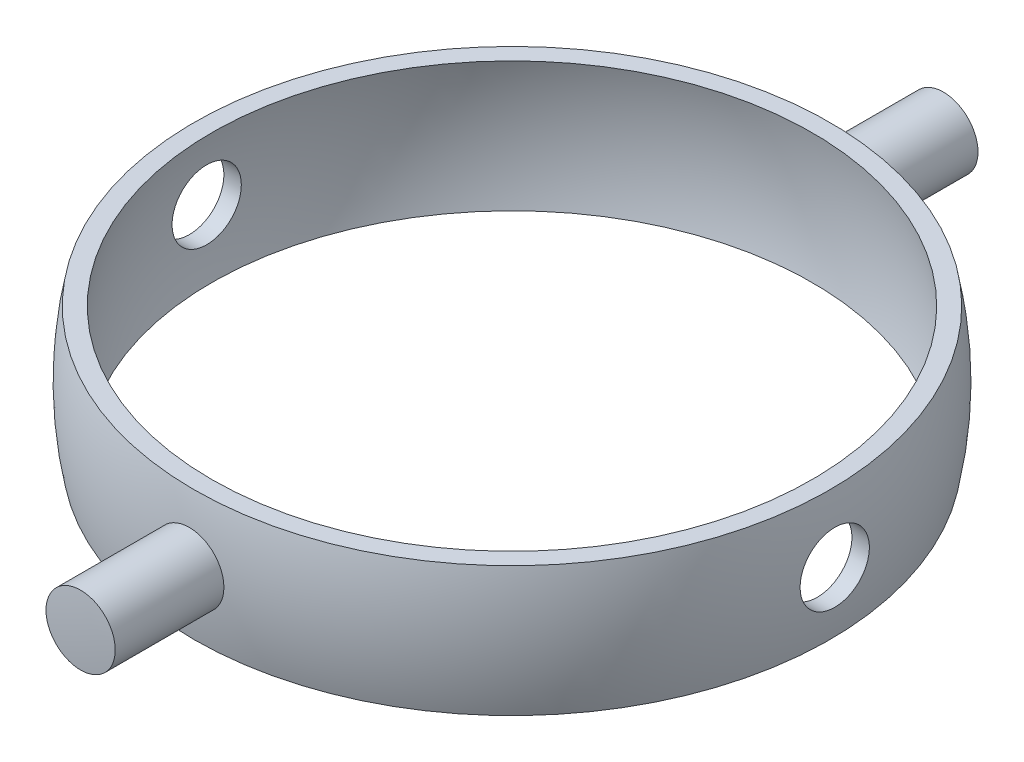
ISO-10303-21;
HEADER;
FILE_DESCRIPTION(('STEP AP214'),'2;1');
FILE_NAME('part.step','',(''),(''),'','','');
FILE_SCHEMA(('AUTOMOTIVE_DESIGN { 1 0 10303 214 1 1 1 1 }'));
ENDSEC;
DATA;
#1=APPLICATION_CONTEXT('core data for automotive mechanical design processes');
#2=APPLICATION_PROTOCOL_DEFINITION('international standard','automotive_design',2000,#1);
#3=PRODUCT_CONTEXT('',#1,'mechanical');
#4=PRODUCT('Part','Part','',(#3));
#5=PRODUCT_RELATED_PRODUCT_CATEGORY('part','',(#4));
#6=PRODUCT_DEFINITION_FORMATION('','',#4);
#7=PRODUCT_DEFINITION_CONTEXT('part definition',#1,'design');
#8=PRODUCT_DEFINITION('design','',#6,#7);
#9=PRODUCT_DEFINITION_SHAPE('','',#8);
#10=(LENGTH_UNIT() NAMED_UNIT(*) SI_UNIT(.MILLI.,.METRE.));
#11=(NAMED_UNIT(*) PLANE_ANGLE_UNIT() SI_UNIT($,.RADIAN.));
#12=(NAMED_UNIT(*) SI_UNIT($,.STERADIAN.) SOLID_ANGLE_UNIT());
#13=UNCERTAINTY_MEASURE_WITH_UNIT(LENGTH_MEASURE(1.E-05),#10,'distance_accuracy_value','');
#14=(GEOMETRIC_REPRESENTATION_CONTEXT(3) GLOBAL_UNCERTAINTY_ASSIGNED_CONTEXT((#13)) GLOBAL_UNIT_ASSIGNED_CONTEXT((#10,
#11,#12)) REPRESENTATION_CONTEXT('',''));
#15=CARTESIAN_POINT('',(0.,0.,0.));
#16=DIRECTION('',(0.,0.,1.));
#17=DIRECTION('',(1.,0.,0.));
#18=AXIS2_PLACEMENT_3D('',#15,#16,#17);
#19=CARTESIAN_POINT('',(0.,0.,0.));
#20=DIRECTION('',(0.,1.,0.));
#21=DIRECTION('',(-1.,0.,0.));
#22=AXIS2_PLACEMENT_3D('',#19,#20,#21);
#23=SPHERICAL_SURFACE('',#22,37.5);
#24=CARTESIAN_POINT('',(0.,7.49999999999999,0.));
#25=DIRECTION('',(0.,1.,0.));
#26=DIRECTION('',(0.,0.,1.));
#27=AXIS2_PLACEMENT_3D('',#24,#25,#26);
#28=CIRCLE('',#27,36.7423461417477);
#29=CARTESIAN_POINT('',(0.,7.49999999999999,36.7423461417477));
#30=VERTEX_POINT('',#29);
#31=EDGE_CURVE('E86',#30,#30,#28,.T.);
#32=ORIENTED_EDGE('',*,*,#31,.F.);
#33=EDGE_LOOP('',(#32));
#34=FACE_BOUND('',#33,.T.);
#35=CARTESIAN_POINT('',(0.,-7.5,0.));
#36=DIRECTION('',(0.,1.,0.));
#37=DIRECTION('',(0.,0.,1.));
#38=AXIS2_PLACEMENT_3D('',#35,#36,#37);
#39=CIRCLE('',#38,36.7423461417477);
#40=CARTESIAN_POINT('',(0.,-7.5,36.7423461417477));
#41=VERTEX_POINT('',#40);
#42=EDGE_CURVE('E83',#41,#41,#39,.T.);
#43=ORIENTED_EDGE('',*,*,#42,.T.);
#44=EDGE_LOOP('',(#43));
#45=FACE_BOUND('',#44,.T.);
#46=CARTESIAN_POINT('',(-37.2860563750043,0.,0.));
#47=DIRECTION('',(1.,0.,0.));
#48=DIRECTION('',(0.,0.,-1.));
#49=AXIS2_PLACEMENT_3D('',#46,#47,#48);
#50=CIRCLE('',#49,4.);
#51=CARTESIAN_POINT('',(-37.2860563750043,0.,-4.));
#52=VERTEX_POINT('',#51);
#53=EDGE_CURVE('E70',#52,#52,#50,.F.);
#54=ORIENTED_EDGE('',*,*,#53,.F.);
#55=EDGE_LOOP('',(#54));
#56=FACE_BOUND('',#55,.T.);
#57=CARTESIAN_POINT('',(37.2860563750043,0.,0.));
#58=DIRECTION('',(-1.,0.,0.));
#59=DIRECTION('',(0.,0.,1.));
#60=AXIS2_PLACEMENT_3D('',#57,#58,#59);
#61=CIRCLE('',#60,4.);
#62=CARTESIAN_POINT('',(37.2860563750043,0.,4.));
#63=VERTEX_POINT('',#62);
#64=EDGE_CURVE('E77',#63,#63,#61,.F.);
#65=ORIENTED_EDGE('',*,*,#64,.F.);
#66=EDGE_LOOP('',(#65));
#67=FACE_BOUND('',#66,.T.);
#68=CARTESIAN_POINT('',(0.,0.,37.2860563750043));
#69=DIRECTION('',(0.,0.,-1.));
#70=DIRECTION('',(-1.,0.,0.));
#71=AXIS2_PLACEMENT_3D('',#68,#69,#70);
#72=CIRCLE('',#71,4.);
#73=CARTESIAN_POINT('',(-4.,0.,37.2860563750043));
#74=VERTEX_POINT('',#73);
#75=EDGE_CURVE('E11',#74,#74,#72,.F.);
#76=ORIENTED_EDGE('',*,*,#75,.F.);
#77=EDGE_LOOP('',(#76));
#78=FACE_BOUND('',#77,.T.);
#79=CARTESIAN_POINT('',(0.,0.,-37.2860563750043));
#80=DIRECTION('',(0.,0.,1.));
#81=DIRECTION('',(1.,0.,0.));
#82=AXIS2_PLACEMENT_3D('',#79,#80,#81);
#83=CIRCLE('',#82,4.);
#84=CARTESIAN_POINT('',(4.,0.,-37.2860563750043));
#85=VERTEX_POINT('',#84);
#86=EDGE_CURVE('E65',#85,#85,#83,.F.);
#87=ORIENTED_EDGE('',*,*,#86,.F.);
#88=EDGE_LOOP('',(#87));
#89=FACE_BOUND('',#88,.T.);
#90=ADVANCED_FACE('F39',(#34,#45,#56,#67,#78,#89),#23,.T.);
#91=CARTESIAN_POINT('',(0.,0.,0.));
#92=DIRECTION('',(0.,1.,0.));
#93=DIRECTION('',(-1.,0.,0.));
#94=AXIS2_PLACEMENT_3D('',#91,#92,#93);
#95=SPHERICAL_SURFACE('',#94,35.5);
#96=CARTESIAN_POINT('',(35.2739280489145,0.,0.));
#97=DIRECTION('',(-1.,0.,0.));
#98=DIRECTION('',(0.,0.,1.));
#99=AXIS2_PLACEMENT_3D('',#96,#97,#98);
#100=CIRCLE('',#99,4.);
#101=CARTESIAN_POINT('',(35.2739280489145,0.,4.));
#102=VERTEX_POINT('',#101);
#103=EDGE_CURVE('E76',#102,#102,#100,.T.);
#104=ORIENTED_EDGE('',*,*,#103,.F.);
#105=EDGE_LOOP('',(#104));
#106=FACE_BOUND('',#105,.T.);
#107=CARTESIAN_POINT('',(-35.2739280489145,0.,0.));
#108=DIRECTION('',(1.,0.,0.));
#109=DIRECTION('',(0.,0.,-1.));
#110=AXIS2_PLACEMENT_3D('',#107,#108,#109);
#111=CIRCLE('',#110,4.);
#112=CARTESIAN_POINT('',(-35.2739280489145,0.,-4.));
#113=VERTEX_POINT('',#112);
#114=EDGE_CURVE('E73',#113,#113,#111,.T.);
#115=ORIENTED_EDGE('',*,*,#114,.F.);
#116=EDGE_LOOP('',(#115));
#117=FACE_BOUND('',#116,.T.);
#118=CARTESIAN_POINT('',(0.,7.5,0.));
#119=DIRECTION('',(0.,1.,0.));
#120=DIRECTION('',(0.,0.,1.));
#121=AXIS2_PLACEMENT_3D('',#118,#119,#120);
#122=CIRCLE('',#121,34.6987031457949);
#123=CARTESIAN_POINT('',(0.,7.5,34.6987031457949));
#124=VERTEX_POINT('',#123);
#125=EDGE_CURVE('E48',#124,#124,#122,.T.);
#126=ORIENTED_EDGE('',*,*,#125,.T.);
#127=EDGE_LOOP('',(#126));
#128=FACE_BOUND('',#127,.T.);
#129=CARTESIAN_POINT('',(0.,-7.50000000000001,0.));
#130=DIRECTION('',(0.,1.,0.));
#131=DIRECTION('',(0.,0.,1.));
#132=AXIS2_PLACEMENT_3D('',#129,#130,#131);
#133=CIRCLE('',#132,34.6987031457949);
#134=CARTESIAN_POINT('',(0.,-7.50000000000001,34.6987031457949));
#135=VERTEX_POINT('',#134);
#136=EDGE_CURVE('E80',#135,#135,#133,.T.);
#137=ORIENTED_EDGE('',*,*,#136,.F.);
#138=EDGE_LOOP('',(#137));
#139=FACE_BOUND('',#138,.T.);
#140=ADVANCED_FACE('F41',(#106,#117,#128,#139),#95,.F.);
#141=CARTESIAN_POINT('',(-36.7423461417477,7.5,0.));
#142=DIRECTION('',(0.,1.,0.));
#143=DIRECTION('',(0.,0.,1.));
#144=AXIS2_PLACEMENT_3D('',#141,#142,#143);
#145=PLANE('',#144);
#146=ORIENTED_EDGE('',*,*,#31,.T.);
#147=EDGE_LOOP('',(#146));
#148=FACE_BOUND('',#147,.T.);
#149=ORIENTED_EDGE('',*,*,#125,.F.);
#150=EDGE_LOOP('',(#149));
#151=FACE_BOUND('',#150,.T.);
#152=ADVANCED_FACE('F121',(#148,#151),#145,.T.);
#153=CARTESIAN_POINT('',(-36.7423461417477,-7.5,0.));
#154=DIRECTION('',(0.,-1.,0.));
#155=DIRECTION('',(0.,0.,-1.));
#156=AXIS2_PLACEMENT_3D('',#153,#154,#155);
#157=PLANE('',#156);
#158=ORIENTED_EDGE('',*,*,#136,.T.);
#159=EDGE_LOOP('',(#158));
#160=FACE_BOUND('',#159,.T.);
#161=ORIENTED_EDGE('',*,*,#42,.F.);
#162=EDGE_LOOP('',(#161));
#163=FACE_BOUND('',#162,.T.);
#164=ADVANCED_FACE('F118',(#160,#163),#157,.T.);
#165=CARTESIAN_POINT('',(-37.5,0.,0.));
#166=DIRECTION('',(1.,0.,0.));
#167=DIRECTION('',(0.,0.,-1.));
#168=AXIS2_PLACEMENT_3D('',#165,#166,#167);
#169=CYLINDRICAL_SURFACE('',#168,4.);
#170=ORIENTED_EDGE('',*,*,#114,.T.);
#171=EDGE_LOOP('',(#170));
#172=FACE_BOUND('',#171,.T.);
#173=ORIENTED_EDGE('',*,*,#53,.T.);
#174=EDGE_LOOP('',(#173));
#175=FACE_BOUND('',#174,.T.);
#176=ADVANCED_FACE('F115',(#172,#175),#169,.F.);
#177=ORIENTED_EDGE('',*,*,#103,.T.);
#178=EDGE_LOOP('',(#177));
#179=FACE_BOUND('',#178,.T.);
#180=ORIENTED_EDGE('',*,*,#64,.T.);
#181=EDGE_LOOP('',(#180));
#182=FACE_BOUND('',#181,.T.);
#183=ADVANCED_FACE('F96',(#179,#182),#169,.F.);
#184=CARTESIAN_POINT('',(0.,0.,-37.501));
#185=DIRECTION('',(0.,0.,1.));
#186=DIRECTION('',(1.,0.,0.));
#187=AXIS2_PLACEMENT_3D('',#184,#185,#186);
#188=CYLINDRICAL_SURFACE('',#187,4.);
#189=CARTESIAN_POINT('',(0.,0.,49.8397431775085));
#190=DIRECTION('',(0.,0.,-1.));
#191=DIRECTION('',(-1.,0.,0.));
#192=AXIS2_PLACEMENT_3D('',#189,#190,#191);
#193=CIRCLE('',#192,4.);
#194=CARTESIAN_POINT('',(-4.,0.,49.8397431775085));
#195=VERTEX_POINT('',#194);
#196=EDGE_CURVE('E63',#195,#195,#193,.F.);
#197=ORIENTED_EDGE('',*,*,#196,.F.);
#198=EDGE_LOOP('',(#197));
#199=FACE_BOUND('',#198,.T.);
#200=ORIENTED_EDGE('',*,*,#75,.T.);
#201=EDGE_LOOP('',(#200));
#202=FACE_BOUND('',#201,.T.);
#203=ADVANCED_FACE('F107',(#199,#202),#188,.T.);
#204=CARTESIAN_POINT('',(0.,0.,50.001));
#205=DIRECTION('',(0.,0.,-1.));
#206=DIRECTION('',(-1.,0.,0.));
#207=AXIS2_PLACEMENT_3D('',#204,#205,#206);
#208=CYLINDRICAL_SURFACE('',#207,4.);
#209=CARTESIAN_POINT('',(0.,0.,-49.8397431775085));
#210=DIRECTION('',(0.,0.,1.));
#211=DIRECTION('',(1.,0.,0.));
#212=AXIS2_PLACEMENT_3D('',#209,#210,#211);
#213=CIRCLE('',#212,4.);
#214=CARTESIAN_POINT('',(4.,0.,-49.8397431775085));
#215=VERTEX_POINT('',#214);
#216=EDGE_CURVE('E43',#215,#215,#213,.T.);
#217=ORIENTED_EDGE('',*,*,#216,.T.);
#218=EDGE_LOOP('',(#217));
#219=FACE_BOUND('',#218,.T.);
#220=ORIENTED_EDGE('',*,*,#86,.T.);
#221=EDGE_LOOP('',(#220));
#222=FACE_BOUND('',#221,.T.);
#223=ADVANCED_FACE('F58',(#219,#222),#208,.T.);
#224=CARTESIAN_POINT('',(0.,0.,0.));
#225=DIRECTION('',(0.,1.,0.));
#226=DIRECTION('',(0.,0.,1.));
#227=AXIS2_PLACEMENT_3D('',#224,#225,#226);
#228=SPHERICAL_SURFACE('',#227,50.);
#229=CARTESIAN_POINT('',(0.,0.,-50.));
#230=VERTEX_POINT('',#229);
#231=VERTEX_LOOP('',#230);
#232=FACE_BOUND('',#231,.T.);
#233=ORIENTED_EDGE('',*,*,#216,.F.);
#234=EDGE_LOOP('',(#233));
#235=FACE_BOUND('',#234,.T.);
#236=ADVANCED_FACE('F54',(#232,#235),#228,.T.);
#237=CARTESIAN_POINT('',(0.,0.,50.));
#238=VERTEX_POINT('',#237);
#239=VERTEX_LOOP('',#238);
#240=FACE_BOUND('',#239,.T.);
#241=ORIENTED_EDGE('',*,*,#196,.T.);
#242=EDGE_LOOP('',(#241));
#243=FACE_BOUND('',#242,.T.);
#244=ADVANCED_FACE('F57',(#240,#243),#228,.T.);
#245=CLOSED_SHELL('',(#90,#140,#152,#164,#176,#183,#203,#223,#236,#244));
#246=MANIFOLD_SOLID_BREP('B2',#245);
#247=ADVANCED_BREP_SHAPE_REPRESENTATION('',(#18,#246),#14);
#248=SHAPE_DEFINITION_REPRESENTATION(#9,#247);
ENDSEC;
END-ISO-10303-21;
